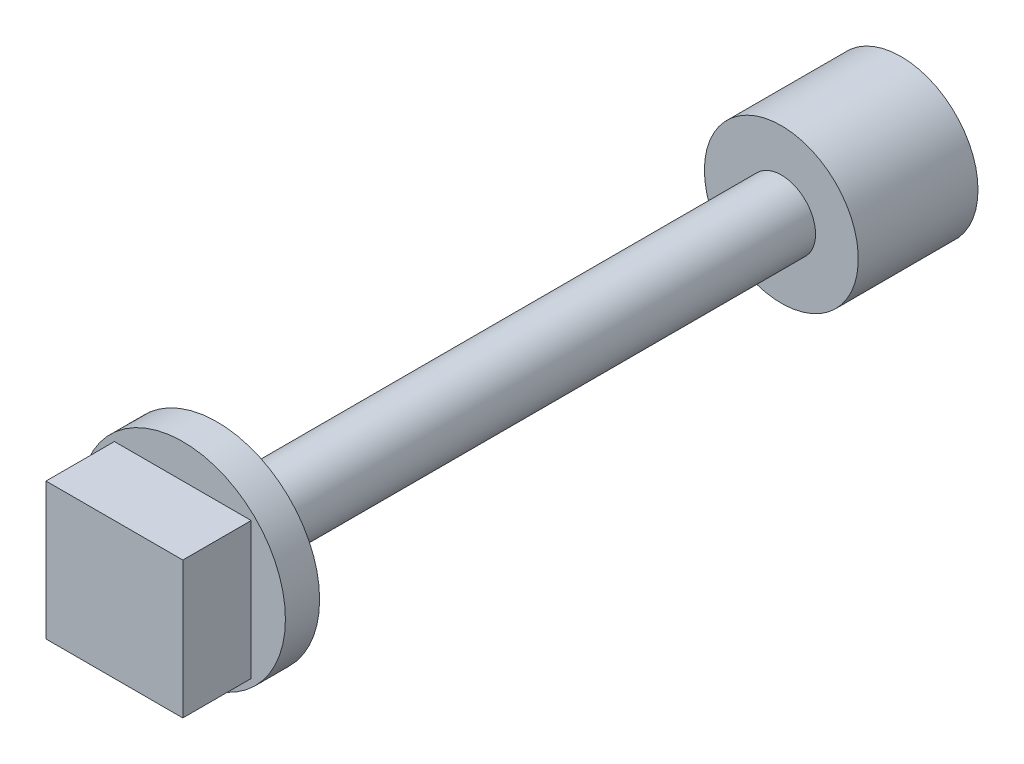
ISO-10303-21;
HEADER;
FILE_DESCRIPTION(('STEP AP214'),'2;1');
FILE_NAME('part.step','',(''),(''),'','','');
FILE_SCHEMA(('AUTOMOTIVE_DESIGN { 1 0 10303 214 1 1 1 1 }'));
ENDSEC;
DATA;
#1=APPLICATION_CONTEXT('core data for automotive mechanical design processes');
#2=APPLICATION_PROTOCOL_DEFINITION('international standard','automotive_design',2000,#1);
#3=PRODUCT_CONTEXT('',#1,'mechanical');
#4=PRODUCT('Part','Part','',(#3));
#5=PRODUCT_RELATED_PRODUCT_CATEGORY('part','',(#4));
#6=PRODUCT_DEFINITION_FORMATION('','',#4);
#7=PRODUCT_DEFINITION_CONTEXT('part definition',#1,'design');
#8=PRODUCT_DEFINITION('design','',#6,#7);
#9=PRODUCT_DEFINITION_SHAPE('','',#8);
#10=(LENGTH_UNIT() NAMED_UNIT(*) SI_UNIT(.MILLI.,.METRE.));
#11=(NAMED_UNIT(*) PLANE_ANGLE_UNIT() SI_UNIT($,.RADIAN.));
#12=(NAMED_UNIT(*) SI_UNIT($,.STERADIAN.) SOLID_ANGLE_UNIT());
#13=UNCERTAINTY_MEASURE_WITH_UNIT(LENGTH_MEASURE(1.E-05),#10,'distance_accuracy_value','');
#14=(GEOMETRIC_REPRESENTATION_CONTEXT(3) GLOBAL_UNCERTAINTY_ASSIGNED_CONTEXT((#13)) GLOBAL_UNIT_ASSIGNED_CONTEXT((#10,
#11,#12)) REPRESENTATION_CONTEXT('',''));
#15=CARTESIAN_POINT('',(0.,0.,0.));
#16=DIRECTION('',(0.,0.,1.));
#17=DIRECTION('',(1.,0.,0.));
#18=AXIS2_PLACEMENT_3D('',#15,#16,#17);
#19=CARTESIAN_POINT('',(0.,0.,21.));
#20=DIRECTION('',(0.,0.,-1.));
#21=DIRECTION('',(-1.,0.,0.));
#22=AXIS2_PLACEMENT_3D('',#19,#20,#21);
#23=CYLINDRICAL_SURFACE('',#22,3.);
#24=CARTESIAN_POINT('',(0.,0.,21.));
#25=DIRECTION('',(0.,0.,1.));
#26=DIRECTION('',(1.,0.,0.));
#27=AXIS2_PLACEMENT_3D('',#24,#25,#26);
#28=CIRCLE('',#27,3.);
#29=CARTESIAN_POINT('',(3.,0.,21.));
#30=VERTEX_POINT('',#29);
#31=EDGE_CURVE('E137',#30,#30,#28,.T.);
#32=ORIENTED_EDGE('',*,*,#31,.F.);
#33=EDGE_LOOP('',(#32));
#34=FACE_BOUND('',#33,.T.);
#35=CARTESIAN_POINT('',(0.,0.,20.));
#36=DIRECTION('',(0.,0.,1.));
#37=DIRECTION('',(1.,0.,0.));
#38=AXIS2_PLACEMENT_3D('',#35,#36,#37);
#39=CIRCLE('',#38,3.);
#40=CARTESIAN_POINT('',(3.,0.,20.));
#41=VERTEX_POINT('',#40);
#42=EDGE_CURVE('E132',#41,#41,#39,.T.);
#43=ORIENTED_EDGE('',*,*,#42,.T.);
#44=EDGE_LOOP('',(#43));
#45=FACE_BOUND('',#44,.T.);
#46=ADVANCED_FACE('F42',(#34,#45),#23,.T.);
#47=CARTESIAN_POINT('',(0.,0.,21.));
#48=DIRECTION('',(0.,0.,1.));
#49=DIRECTION('',(1.,0.,0.));
#50=AXIS2_PLACEMENT_3D('',#47,#48,#49);
#51=PLANE('',#50);
#52=DIRECTION('',(0.,-1.,0.));
#53=VECTOR('',#52,1.);
#54=CARTESIAN_POINT('',(-2.,-2.,21.));
#55=LINE('',#54,#53);
#56=CARTESIAN_POINT('',(-2.,2.,21.));
#57=VERTEX_POINT('',#56);
#58=CARTESIAN_POINT('',(-2.,-2.,21.));
#59=VERTEX_POINT('',#58);
#60=EDGE_CURVE('E59',#57,#59,#55,.T.);
#61=ORIENTED_EDGE('',*,*,#60,.F.);
#62=DIRECTION('',(-1.,0.,0.));
#63=VECTOR('',#62,1.);
#64=CARTESIAN_POINT('',(2.,2.,21.));
#65=LINE('',#64,#63);
#66=CARTESIAN_POINT('',(2.,2.,21.));
#67=VERTEX_POINT('',#66);
#68=EDGE_CURVE('E63',#67,#57,#65,.T.);
#69=ORIENTED_EDGE('',*,*,#68,.F.);
#70=DIRECTION('',(0.,1.,0.));
#71=VECTOR('',#70,1.);
#72=CARTESIAN_POINT('',(2.,-2.,21.));
#73=LINE('',#72,#71);
#74=CARTESIAN_POINT('',(2.,-2.,21.));
#75=VERTEX_POINT('',#74);
#76=EDGE_CURVE('E286',#75,#67,#73,.T.);
#77=ORIENTED_EDGE('',*,*,#76,.F.);
#78=DIRECTION('',(1.,0.,0.));
#79=VECTOR('',#78,1.);
#80=CARTESIAN_POINT('',(2.,-2.,21.));
#81=LINE('',#80,#79);
#82=EDGE_CURVE('E283',#59,#75,#81,.T.);
#83=ORIENTED_EDGE('',*,*,#82,.F.);
#84=EDGE_LOOP('',(#61,#69,#77,#83));
#85=FACE_BOUND('',#84,.T.);
#86=ORIENTED_EDGE('',*,*,#31,.T.);
#87=EDGE_LOOP('',(#86));
#88=FACE_BOUND('',#87,.T.);
#89=ADVANCED_FACE('F219',(#85,#88),#51,.T.);
#90=CARTESIAN_POINT('',(0.,0.,20.));
#91=DIRECTION('',(0.,0.,1.));
#92=DIRECTION('',(1.,0.,0.));
#93=AXIS2_PLACEMENT_3D('',#90,#91,#92);
#94=PLANE('',#93);
#95=ORIENTED_EDGE('',*,*,#42,.F.);
#96=EDGE_LOOP('',(#95));
#97=FACE_BOUND('',#96,.T.);
#98=CARTESIAN_POINT('',(0.,0.,20.));
#99=DIRECTION('',(0.,0.,1.));
#100=DIRECTION('',(1.,0.,0.));
#101=AXIS2_PLACEMENT_3D('',#98,#99,#100);
#102=CIRCLE('',#101,1.);
#103=CARTESIAN_POINT('',(1.,0.,20.));
#104=VERTEX_POINT('',#103);
#105=EDGE_CURVE('E269',#104,#104,#102,.T.);
#106=ORIENTED_EDGE('',*,*,#105,.T.);
#107=EDGE_LOOP('',(#106));
#108=FACE_BOUND('',#107,.T.);
#109=ADVANCED_FACE('F225',(#97,#108),#94,.F.);
#110=CARTESIAN_POINT('',(-2.,-2.,23.));
#111=DIRECTION('',(1.,0.,0.));
#112=DIRECTION('',(0.,0.,-1.));
#113=AXIS2_PLACEMENT_3D('',#110,#111,#112);
#114=PLANE('',#113);
#115=ORIENTED_EDGE('',*,*,#60,.T.);
#116=DIRECTION('',(0.,0.,-1.));
#117=VECTOR('',#116,1.);
#118=CARTESIAN_POINT('',(-2.,-2.,23.));
#119=LINE('',#118,#117);
#120=CARTESIAN_POINT('',(-2.,-2.,23.));
#121=VERTEX_POINT('',#120);
#122=EDGE_CURVE('E112',#121,#59,#119,.T.);
#123=ORIENTED_EDGE('',*,*,#122,.F.);
#124=DIRECTION('',(0.,-1.,0.));
#125=VECTOR('',#124,1.);
#126=CARTESIAN_POINT('',(-2.,-2.,23.));
#127=LINE('',#126,#125);
#128=CARTESIAN_POINT('',(-2.,2.,23.));
#129=VERTEX_POINT('',#128);
#130=EDGE_CURVE('E119',#129,#121,#127,.T.);
#131=ORIENTED_EDGE('',*,*,#130,.F.);
#132=DIRECTION('',(0.,0.,-1.));
#133=VECTOR('',#132,1.);
#134=CARTESIAN_POINT('',(-2.,2.,23.));
#135=LINE('',#134,#133);
#136=EDGE_CURVE('E280',#129,#57,#135,.T.);
#137=ORIENTED_EDGE('',*,*,#136,.T.);
#138=EDGE_LOOP('',(#115,#123,#131,#137));
#139=FACE_BOUND('',#138,.T.);
#140=ADVANCED_FACE('F130',(#139),#114,.F.);
#141=CARTESIAN_POINT('',(2.,-2.,23.));
#142=DIRECTION('',(0.,1.,0.));
#143=DIRECTION('',(-1.,0.,0.));
#144=AXIS2_PLACEMENT_3D('',#141,#142,#143);
#145=PLANE('',#144);
#146=ORIENTED_EDGE('',*,*,#82,.T.);
#147=DIRECTION('',(0.,0.,-1.));
#148=VECTOR('',#147,1.);
#149=CARTESIAN_POINT('',(2.,-2.,23.));
#150=LINE('',#149,#148);
#151=CARTESIAN_POINT('',(2.,-2.,23.));
#152=VERTEX_POINT('',#151);
#153=EDGE_CURVE('E114',#152,#75,#150,.T.);
#154=ORIENTED_EDGE('',*,*,#153,.F.);
#155=DIRECTION('',(1.,0.,0.));
#156=VECTOR('',#155,1.);
#157=CARTESIAN_POINT('',(2.,-2.,23.));
#158=LINE('',#157,#156);
#159=EDGE_CURVE('E107',#121,#152,#158,.T.);
#160=ORIENTED_EDGE('',*,*,#159,.F.);
#161=ORIENTED_EDGE('',*,*,#122,.T.);
#162=EDGE_LOOP('',(#146,#154,#160,#161));
#163=FACE_BOUND('',#162,.T.);
#164=ADVANCED_FACE('F110',(#163),#145,.F.);
#165=CARTESIAN_POINT('',(2.,-2.,23.));
#166=DIRECTION('',(-1.,0.,0.));
#167=DIRECTION('',(0.,-1.,0.));
#168=AXIS2_PLACEMENT_3D('',#165,#166,#167);
#169=PLANE('',#168);
#170=ORIENTED_EDGE('',*,*,#76,.T.);
#171=DIRECTION('',(0.,0.,-1.));
#172=VECTOR('',#171,1.);
#173=CARTESIAN_POINT('',(2.,2.,23.));
#174=LINE('',#173,#172);
#175=CARTESIAN_POINT('',(2.,2.,23.));
#176=VERTEX_POINT('',#175);
#177=EDGE_CURVE('E139',#176,#67,#174,.T.);
#178=ORIENTED_EDGE('',*,*,#177,.F.);
#179=DIRECTION('',(0.,1.,0.));
#180=VECTOR('',#179,1.);
#181=CARTESIAN_POINT('',(2.,-2.,23.));
#182=LINE('',#181,#180);
#183=EDGE_CURVE('E118',#152,#176,#182,.T.);
#184=ORIENTED_EDGE('',*,*,#183,.F.);
#185=ORIENTED_EDGE('',*,*,#153,.T.);
#186=EDGE_LOOP('',(#170,#178,#184,#185));
#187=FACE_BOUND('',#186,.T.);
#188=ADVANCED_FACE('F251',(#187),#169,.F.);
#189=CARTESIAN_POINT('',(2.,2.,23.));
#190=DIRECTION('',(0.,-1.,0.));
#191=DIRECTION('',(1.,0.,0.));
#192=AXIS2_PLACEMENT_3D('',#189,#190,#191);
#193=PLANE('',#192);
#194=ORIENTED_EDGE('',*,*,#68,.T.);
#195=ORIENTED_EDGE('',*,*,#136,.F.);
#196=DIRECTION('',(-1.,0.,0.));
#197=VECTOR('',#196,1.);
#198=CARTESIAN_POINT('',(2.,2.,23.));
#199=LINE('',#198,#197);
#200=EDGE_CURVE('E124',#176,#129,#199,.T.);
#201=ORIENTED_EDGE('',*,*,#200,.F.);
#202=ORIENTED_EDGE('',*,*,#177,.T.);
#203=EDGE_LOOP('',(#194,#195,#201,#202));
#204=FACE_BOUND('',#203,.T.);
#205=ADVANCED_FACE('F248',(#204),#193,.F.);
#206=CARTESIAN_POINT('',(0.,0.,23.));
#207=DIRECTION('',(0.,0.,1.));
#208=DIRECTION('',(1.,0.,0.));
#209=AXIS2_PLACEMENT_3D('',#206,#207,#208);
#210=PLANE('',#209);
#211=ORIENTED_EDGE('',*,*,#130,.T.);
#212=ORIENTED_EDGE('',*,*,#159,.T.);
#213=ORIENTED_EDGE('',*,*,#183,.T.);
#214=ORIENTED_EDGE('',*,*,#200,.T.);
#215=EDGE_LOOP('',(#211,#212,#213,#214));
#216=FACE_BOUND('',#215,.T.);
#217=ADVANCED_FACE('F122',(#216),#210,.T.);
#218=CARTESIAN_POINT('',(0.,0.,3.5));
#219=DIRECTION('',(0.,0.,-1.));
#220=DIRECTION('',(-1.,0.,0.));
#221=AXIS2_PLACEMENT_3D('',#218,#219,#220);
#222=PLANE('',#221);
#223=CARTESIAN_POINT('',(0.,0.,3.5));
#224=DIRECTION('',(0.,0.,1.));
#225=DIRECTION('',(1.,0.,0.));
#226=AXIS2_PLACEMENT_3D('',#223,#224,#225);
#227=CIRCLE('',#226,1.);
#228=CARTESIAN_POINT('',(1.,0.,3.5));
#229=VERTEX_POINT('',#228);
#230=EDGE_CURVE('E271',#229,#229,#227,.T.);
#231=ORIENTED_EDGE('',*,*,#230,.F.);
#232=EDGE_LOOP('',(#231));
#233=FACE_BOUND('',#232,.T.);
#234=CARTESIAN_POINT('',(0.,0.,3.5));
#235=DIRECTION('',(0.,0.,-1.));
#236=DIRECTION('',(-1.,0.,0.));
#237=AXIS2_PLACEMENT_3D('',#234,#235,#236);
#238=CIRCLE('',#237,2.25);
#239=CARTESIAN_POINT('',(-2.25,0.,3.5));
#240=VERTEX_POINT('',#239);
#241=EDGE_CURVE('E46',#240,#240,#238,.T.);
#242=ORIENTED_EDGE('',*,*,#241,.F.);
#243=EDGE_LOOP('',(#242));
#244=FACE_BOUND('',#243,.T.);
#245=ADVANCED_FACE('F235',(#233,#244),#222,.F.);
#246=CARTESIAN_POINT('',(0.,0.,3.5));
#247=DIRECTION('',(0.,0.,1.));
#248=DIRECTION('',(1.,0.,0.));
#249=AXIS2_PLACEMENT_3D('',#246,#247,#248);
#250=CYLINDRICAL_SURFACE('',#249,1.);
#251=ORIENTED_EDGE('',*,*,#230,.T.);
#252=EDGE_LOOP('',(#251));
#253=FACE_BOUND('',#252,.T.);
#254=ORIENTED_EDGE('',*,*,#105,.F.);
#255=EDGE_LOOP('',(#254));
#256=FACE_BOUND('',#255,.T.);
#257=ADVANCED_FACE('F231',(#253,#256),#250,.T.);
#258=CARTESIAN_POINT('',(0.,0.,2.5));
#259=DIRECTION('',(0.,0.,-1.));
#260=DIRECTION('',(-1.,0.,0.));
#261=AXIS2_PLACEMENT_3D('',#258,#259,#260);
#262=PLANE('',#261);
#263=DIRECTION('',(0.,-1.,0.));
#264=VECTOR('',#263,1.);
#265=CARTESIAN_POINT('',(1.2,0.,2.5));
#266=LINE('',#265,#264);
#267=CARTESIAN_POINT('',(1.2,1.2,2.5));
#268=VERTEX_POINT('',#267);
#269=CARTESIAN_POINT('',(1.2,-1.2,2.5));
#270=VERTEX_POINT('',#269);
#271=EDGE_CURVE('E147',#268,#270,#266,.T.);
#272=ORIENTED_EDGE('',*,*,#271,.T.);
#273=DIRECTION('',(-1.,0.,0.));
#274=VECTOR('',#273,1.);
#275=CARTESIAN_POINT('',(0.,-1.2,2.5));
#276=LINE('',#275,#274);
#277=CARTESIAN_POINT('',(-1.2,-1.2,2.5));
#278=VERTEX_POINT('',#277);
#279=EDGE_CURVE('E151',#270,#278,#276,.T.);
#280=ORIENTED_EDGE('',*,*,#279,.T.);
#281=DIRECTION('',(0.,1.,0.));
#282=VECTOR('',#281,1.);
#283=CARTESIAN_POINT('',(-1.2,0.,2.5));
#284=LINE('',#283,#282);
#285=CARTESIAN_POINT('',(-1.2,1.2,2.5));
#286=VERTEX_POINT('',#285);
#287=EDGE_CURVE('E156',#278,#286,#284,.T.);
#288=ORIENTED_EDGE('',*,*,#287,.T.);
#289=DIRECTION('',(1.,0.,0.));
#290=VECTOR('',#289,1.);
#291=CARTESIAN_POINT('',(0.,1.2,2.5));
#292=LINE('',#291,#290);
#293=EDGE_CURVE('E160',#286,#268,#292,.T.);
#294=ORIENTED_EDGE('',*,*,#293,.T.);
#295=EDGE_LOOP('',(#272,#280,#288,#294));
#296=FACE_BOUND('',#295,.T.);
#297=ADVANCED_FACE('F205',(#296),#262,.T.);
#298=CARTESIAN_POINT('',(-1.2,0.,2.5));
#299=DIRECTION('',(-1.,0.,0.));
#300=DIRECTION('',(0.,0.,1.));
#301=AXIS2_PLACEMENT_3D('',#298,#299,#300);
#302=PLANE('',#301);
#303=DIRECTION('',(0.,1.,0.));
#304=VECTOR('',#303,1.);
#305=CARTESIAN_POINT('',(-1.2,0.,0.));
#306=LINE('',#305,#304);
#307=CARTESIAN_POINT('',(-1.2,-1.2,0.));
#308=VERTEX_POINT('',#307);
#309=CARTESIAN_POINT('',(-1.2,1.2,0.));
#310=VERTEX_POINT('',#309);
#311=EDGE_CURVE('E171',#308,#310,#306,.T.);
#312=ORIENTED_EDGE('',*,*,#311,.T.);
#313=DIRECTION('',(0.,0.,-1.));
#314=VECTOR('',#313,1.);
#315=CARTESIAN_POINT('',(-1.2,1.2,2.5));
#316=LINE('',#315,#314);
#317=EDGE_CURVE('E180',#286,#310,#316,.T.);
#318=ORIENTED_EDGE('',*,*,#317,.F.);
#319=ORIENTED_EDGE('',*,*,#287,.F.);
#320=DIRECTION('',(0.,0.,-1.));
#321=VECTOR('',#320,1.);
#322=CARTESIAN_POINT('',(-1.2,-1.2,2.5));
#323=LINE('',#322,#321);
#324=EDGE_CURVE('E183',#278,#308,#323,.T.);
#325=ORIENTED_EDGE('',*,*,#324,.T.);
#326=EDGE_LOOP('',(#312,#318,#319,#325));
#327=FACE_BOUND('',#326,.T.);
#328=ADVANCED_FACE('F201',(#327),#302,.F.);
#329=CARTESIAN_POINT('',(0.,1.2,2.5));
#330=DIRECTION('',(0.,1.,0.));
#331=DIRECTION('',(-1.,0.,0.));
#332=AXIS2_PLACEMENT_3D('',#329,#330,#331);
#333=PLANE('',#332);
#334=DIRECTION('',(1.,0.,0.));
#335=VECTOR('',#334,1.);
#336=CARTESIAN_POINT('',(0.,1.2,0.));
#337=LINE('',#336,#335);
#338=CARTESIAN_POINT('',(1.2,1.2,0.));
#339=VERTEX_POINT('',#338);
#340=EDGE_CURVE('E152',#310,#339,#337,.T.);
#341=ORIENTED_EDGE('',*,*,#340,.T.);
#342=DIRECTION('',(0.,0.,-1.));
#343=VECTOR('',#342,1.);
#344=CARTESIAN_POINT('',(1.2,1.2,2.5));
#345=LINE('',#344,#343);
#346=EDGE_CURVE('E52',#268,#339,#345,.T.);
#347=ORIENTED_EDGE('',*,*,#346,.F.);
#348=ORIENTED_EDGE('',*,*,#293,.F.);
#349=ORIENTED_EDGE('',*,*,#317,.T.);
#350=EDGE_LOOP('',(#341,#347,#348,#349));
#351=FACE_BOUND('',#350,.T.);
#352=ADVANCED_FACE('F208',(#351),#333,.F.);
#353=CARTESIAN_POINT('',(1.2,0.,2.5));
#354=DIRECTION('',(1.,0.,0.));
#355=DIRECTION('',(0.,0.,-1.));
#356=AXIS2_PLACEMENT_3D('',#353,#354,#355);
#357=PLANE('',#356);
#358=DIRECTION('',(0.,-1.,0.));
#359=VECTOR('',#358,1.);
#360=CARTESIAN_POINT('',(1.2,0.,0.));
#361=LINE('',#360,#359);
#362=CARTESIAN_POINT('',(1.2,-1.2,0.));
#363=VERTEX_POINT('',#362);
#364=EDGE_CURVE('E145',#339,#363,#361,.T.);
#365=ORIENTED_EDGE('',*,*,#364,.T.);
#366=DIRECTION('',(0.,0.,-1.));
#367=VECTOR('',#366,1.);
#368=CARTESIAN_POINT('',(1.2,-1.2,2.5));
#369=LINE('',#368,#367);
#370=EDGE_CURVE('E164',#270,#363,#369,.T.);
#371=ORIENTED_EDGE('',*,*,#370,.F.);
#372=ORIENTED_EDGE('',*,*,#271,.F.);
#373=ORIENTED_EDGE('',*,*,#346,.T.);
#374=EDGE_LOOP('',(#365,#371,#372,#373));
#375=FACE_BOUND('',#374,.T.);
#376=ADVANCED_FACE('F206',(#375),#357,.F.);
#377=CARTESIAN_POINT('',(0.,-1.2,2.5));
#378=DIRECTION('',(0.,-1.,0.));
#379=DIRECTION('',(1.,0.,0.));
#380=AXIS2_PLACEMENT_3D('',#377,#378,#379);
#381=PLANE('',#380);
#382=DIRECTION('',(-1.,0.,0.));
#383=VECTOR('',#382,1.);
#384=CARTESIAN_POINT('',(0.,-1.2,0.));
#385=LINE('',#384,#383);
#386=EDGE_CURVE('E167',#363,#308,#385,.T.);
#387=ORIENTED_EDGE('',*,*,#386,.T.);
#388=ORIENTED_EDGE('',*,*,#324,.F.);
#389=ORIENTED_EDGE('',*,*,#279,.F.);
#390=ORIENTED_EDGE('',*,*,#370,.T.);
#391=EDGE_LOOP('',(#387,#388,#389,#390));
#392=FACE_BOUND('',#391,.T.);
#393=ADVANCED_FACE('F191',(#392),#381,.F.);
#394=CARTESIAN_POINT('',(0.,0.,0.));
#395=DIRECTION('',(0.,0.,1.));
#396=DIRECTION('',(1.,0.,0.));
#397=AXIS2_PLACEMENT_3D('',#394,#395,#396);
#398=PLANE('',#397);
#399=ORIENTED_EDGE('',*,*,#386,.F.);
#400=ORIENTED_EDGE('',*,*,#364,.F.);
#401=ORIENTED_EDGE('',*,*,#340,.F.);
#402=ORIENTED_EDGE('',*,*,#311,.F.);
#403=EDGE_LOOP('',(#399,#400,#401,#402));
#404=FACE_BOUND('',#403,.T.);
#405=CARTESIAN_POINT('',(0.,0.,0.));
#406=DIRECTION('',(0.,0.,1.));
#407=DIRECTION('',(1.,0.,0.));
#408=AXIS2_PLACEMENT_3D('',#405,#406,#407);
#409=CIRCLE('',#408,2.25);
#410=CARTESIAN_POINT('',(2.25,0.,0.));
#411=VERTEX_POINT('',#410);
#412=EDGE_CURVE('E12',#411,#411,#409,.T.);
#413=ORIENTED_EDGE('',*,*,#412,.F.);
#414=EDGE_LOOP('',(#413));
#415=FACE_BOUND('',#414,.T.);
#416=ADVANCED_FACE('F197',(#404,#415),#398,.F.);
#417=CARTESIAN_POINT('',(0.,0.,20.));
#418=DIRECTION('',(0.,0.,-1.));
#419=DIRECTION('',(-1.,0.,0.));
#420=AXIS2_PLACEMENT_3D('',#417,#418,#419);
#421=CYLINDRICAL_SURFACE('',#420,2.25);
#422=ORIENTED_EDGE('',*,*,#241,.T.);
#423=EDGE_LOOP('',(#422));
#424=FACE_BOUND('',#423,.T.);
#425=ORIENTED_EDGE('',*,*,#412,.T.);
#426=EDGE_LOOP('',(#425));
#427=FACE_BOUND('',#426,.T.);
#428=ADVANCED_FACE('F44',(#424,#427),#421,.T.);
#429=CLOSED_SHELL('',(#46,#89,#109,#140,#164,#188,#205,#217,#245,#257,#297,#328,#352,#376,#393,
#416,#428));
#430=MANIFOLD_SOLID_BREP('B2',#429);
#431=ADVANCED_BREP_SHAPE_REPRESENTATION('',(#18,#430),#14);
#432=SHAPE_DEFINITION_REPRESENTATION(#9,#431);
ENDSEC;
END-ISO-10303-21;
